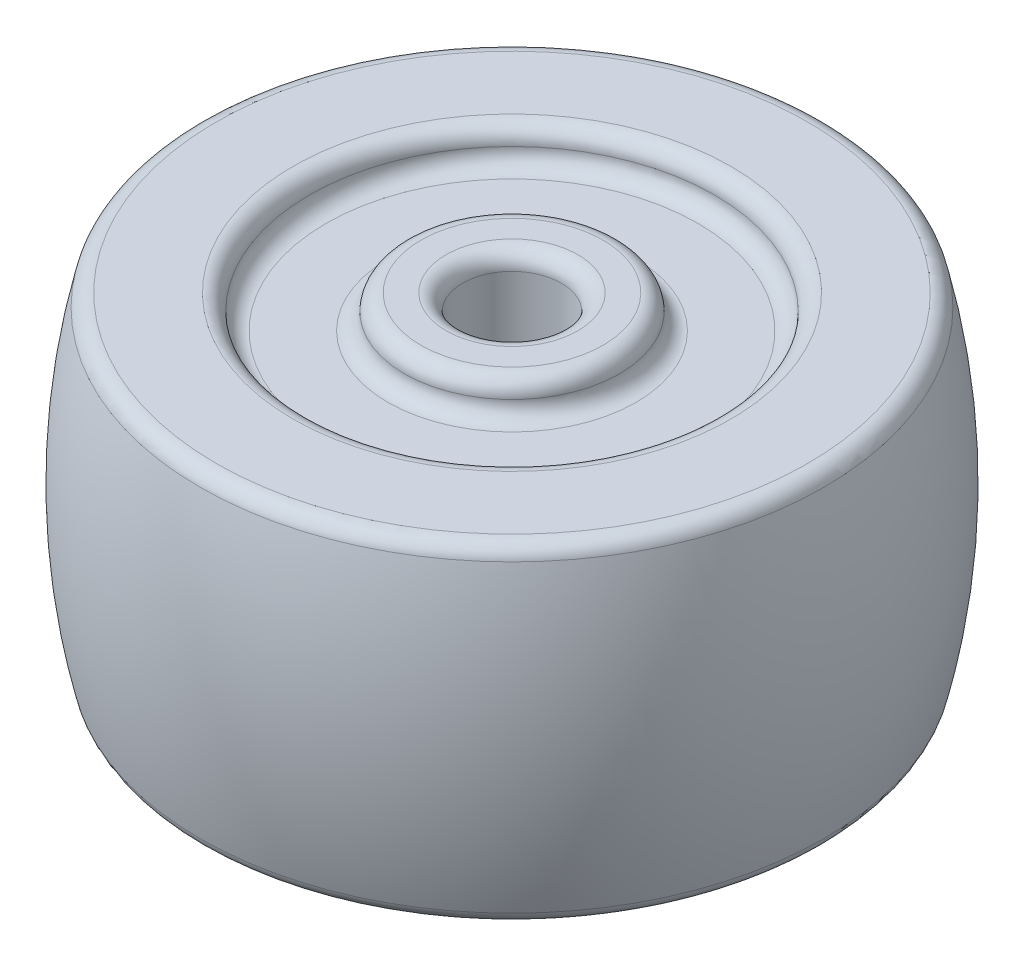
ISO-10303-21;
HEADER;
FILE_DESCRIPTION(('STEP AP214'),'2;1');
FILE_NAME('part.step','',(''),(''),'','','');
FILE_SCHEMA(('AUTOMOTIVE_DESIGN { 1 0 10303 214 1 1 1 1 }'));
ENDSEC;
DATA;
#1=APPLICATION_CONTEXT('core data for automotive mechanical design processes');
#2=APPLICATION_PROTOCOL_DEFINITION('international standard','automotive_design',2000,#1);
#3=PRODUCT_CONTEXT('',#1,'mechanical');
#4=PRODUCT('Part','Part','',(#3));
#5=PRODUCT_RELATED_PRODUCT_CATEGORY('part','',(#4));
#6=PRODUCT_DEFINITION_FORMATION('','',#4);
#7=PRODUCT_DEFINITION_CONTEXT('part definition',#1,'design');
#8=PRODUCT_DEFINITION('design','',#6,#7);
#9=PRODUCT_DEFINITION_SHAPE('','',#8);
#10=(LENGTH_UNIT() NAMED_UNIT(*) SI_UNIT(.MILLI.,.METRE.));
#11=(NAMED_UNIT(*) PLANE_ANGLE_UNIT() SI_UNIT($,.RADIAN.));
#12=(NAMED_UNIT(*) SI_UNIT($,.STERADIAN.) SOLID_ANGLE_UNIT());
#13=UNCERTAINTY_MEASURE_WITH_UNIT(LENGTH_MEASURE(1.E-05),#10,'distance_accuracy_value','');
#14=(GEOMETRIC_REPRESENTATION_CONTEXT(3) GLOBAL_UNCERTAINTY_ASSIGNED_CONTEXT((#13)) GLOBAL_UNIT_ASSIGNED_CONTEXT((#10,
#11,#12)) REPRESENTATION_CONTEXT('',''));
#15=CARTESIAN_POINT('',(0.,0.,0.));
#16=DIRECTION('',(0.,0.,1.));
#17=DIRECTION('',(1.,0.,0.));
#18=AXIS2_PLACEMENT_3D('',#15,#16,#17);
#19=CARTESIAN_POINT('',(0.,10.,0.));
#20=DIRECTION('',(0.,1.,0.));
#21=DIRECTION('',(0.,0.,1.));
#22=AXIS2_PLACEMENT_3D('',#19,#20,#21);
#23=PLANE('',#22);
#24=CARTESIAN_POINT('',(0.,10.,0.));
#25=DIRECTION('',(0.,1.,0.));
#26=DIRECTION('',(0.,0.,1.));
#27=AXIS2_PLACEMENT_3D('',#24,#25,#26);
#28=CIRCLE('',#27,13.2832027979486);
#29=CARTESIAN_POINT('',(0.,10.,13.2832027979486));
#30=VERTEX_POINT('',#29);
#31=EDGE_CURVE('E10',#30,#30,#28,.F.);
#32=ORIENTED_EDGE('',*,*,#31,.T.);
#33=EDGE_LOOP('',(#32));
#34=FACE_BOUND('',#33,.T.);
#35=CARTESIAN_POINT('',(0.,10.,0.));
#36=DIRECTION('',(0.,1.,0.));
#37=DIRECTION('',(0.,0.,1.));
#38=AXIS2_PLACEMENT_3D('',#35,#36,#37);
#39=CIRCLE('',#38,17.9473319220205);
#40=CARTESIAN_POINT('',(0.,10.,17.9473319220205));
#41=VERTEX_POINT('',#40);
#42=EDGE_CURVE('E42',#41,#41,#39,.T.);
#43=ORIENTED_EDGE('',*,*,#42,.T.);
#44=EDGE_LOOP('',(#43));
#45=FACE_BOUND('',#44,.T.);
#46=ADVANCED_FACE('F34',(#34,#45),#23,.T.);
#47=CARTESIAN_POINT('',(0.,0.,0.));
#48=DIRECTION('',(0.,1.,0.));
#49=DIRECTION('',(0.,0.,1.));
#50=AXIS2_PLACEMENT_3D('',#47,#48,#49);
#51=DEGENERATE_TOROIDAL_SURFACE('',#50,20.,40.,.F.);
#52=CARTESIAN_POINT('',(0.,-9.23076923076923,0.));
#53=DIRECTION('',(0.,1.,0.));
#54=DIRECTION('',(0.,0.,1.));
#55=AXIS2_PLACEMENT_3D('',#52,#53,#54);
#56=CIRCLE('',#55,18.9203404328416);
#57=CARTESIAN_POINT('',(0.,-9.23076923076923,18.9203404328416));
#58=VERTEX_POINT('',#57);
#59=EDGE_CURVE('E176',#58,#58,#56,.T.);
#60=ORIENTED_EDGE('',*,*,#59,.T.);
#61=EDGE_LOOP('',(#60));
#62=FACE_BOUND('',#61,.T.);
#63=CARTESIAN_POINT('',(0.,9.23076923076923,0.));
#64=DIRECTION('',(0.,-1.,0.));
#65=DIRECTION('',(0.,0.,-1.));
#66=AXIS2_PLACEMENT_3D('',#63,#64,#65);
#67=CIRCLE('',#66,18.9203404328416);
#68=CARTESIAN_POINT('',(0.,9.23076923076923,-18.9203404328416));
#69=VERTEX_POINT('',#68);
#70=EDGE_CURVE('E173',#69,#69,#67,.T.);
#71=ORIENTED_EDGE('',*,*,#70,.T.);
#72=EDGE_LOOP('',(#71));
#73=FACE_BOUND('',#72,.T.);
#74=ADVANCED_FACE('F80',(#62,#73),#51,.F.);
#75=CARTESIAN_POINT('',(0.,-10.,0.));
#76=DIRECTION('',(0.,1.,0.));
#77=DIRECTION('',(0.,0.,1.));
#78=AXIS2_PLACEMENT_3D('',#75,#76,#77);
#79=PLANE('',#78);
#80=CARTESIAN_POINT('',(0.,-10.,0.));
#81=DIRECTION('',(0.,1.,0.));
#82=DIRECTION('',(0.,0.,1.));
#83=AXIS2_PLACEMENT_3D('',#80,#81,#82);
#84=CIRCLE('',#83,13.2832027979486);
#85=CARTESIAN_POINT('',(0.,-10.,13.2832027979486));
#86=VERTEX_POINT('',#85);
#87=EDGE_CURVE('E177',#86,#86,#84,.T.);
#88=ORIENTED_EDGE('',*,*,#87,.T.);
#89=EDGE_LOOP('',(#88));
#90=FACE_BOUND('',#89,.T.);
#91=CARTESIAN_POINT('',(0.,-10.,0.));
#92=DIRECTION('',(0.,1.,0.));
#93=DIRECTION('',(0.,0.,1.));
#94=AXIS2_PLACEMENT_3D('',#91,#92,#93);
#95=CIRCLE('',#94,17.9473319220205);
#96=CARTESIAN_POINT('',(0.,-10.,17.9473319220205));
#97=VERTEX_POINT('',#96);
#98=EDGE_CURVE('E183',#97,#97,#95,.F.);
#99=ORIENTED_EDGE('',*,*,#98,.T.);
#100=EDGE_LOOP('',(#99));
#101=FACE_BOUND('',#100,.T.);
#102=ADVANCED_FACE('F85',(#90,#101),#79,.F.);
#103=CARTESIAN_POINT('',(0.,-8.,0.));
#104=DIRECTION('',(0.,-1.,0.));
#105=DIRECTION('',(0.,0.,-1.));
#106=AXIS2_PLACEMENT_3D('',#103,#104,#105);
#107=PLANE('',#106);
#108=CARTESIAN_POINT('',(0.,-8.,0.));
#109=DIRECTION('',(0.,-1.,0.));
#110=DIRECTION('',(0.,0.,-1.));
#111=AXIS2_PLACEMENT_3D('',#108,#109,#110);
#112=CIRCLE('',#111,11.2832027979486);
#113=CARTESIAN_POINT('',(0.,-8.,-11.2832027979486));
#114=VERTEX_POINT('',#113);
#115=EDGE_CURVE('E249',#114,#114,#112,.T.);
#116=ORIENTED_EDGE('',*,*,#115,.T.);
#117=EDGE_LOOP('',(#116));
#118=FACE_BOUND('',#117,.T.);
#119=CARTESIAN_POINT('',(0.,-8.,0.));
#120=DIRECTION('',(0.,1.,0.));
#121=DIRECTION('',(0.,0.,1.));
#122=AXIS2_PLACEMENT_3D('',#119,#120,#121);
#123=CIRCLE('',#122,6.52854703681058);
#124=CARTESIAN_POINT('',(0.,-8.,6.52854703681058));
#125=VERTEX_POINT('',#124);
#126=EDGE_CURVE('E53',#125,#125,#123,.T.);
#127=ORIENTED_EDGE('',*,*,#126,.T.);
#128=EDGE_LOOP('',(#127));
#129=FACE_BOUND('',#128,.T.);
#130=ADVANCED_FACE('F216',(#118,#129),#107,.T.);
#131=CARTESIAN_POINT('',(0.,10.,0.));
#132=DIRECTION('',(0.,1.,0.));
#133=DIRECTION('',(0.,0.,1.));
#134=AXIS2_PLACEMENT_3D('',#131,#132,#133);
#135=CYLINDRICAL_SURFACE('',#134,6.52854703681058);
#136=CARTESIAN_POINT('',(0.,-9.,0.));
#137=DIRECTION('',(0.,1.,0.));
#138=DIRECTION('',(0.,0.,1.));
#139=AXIS2_PLACEMENT_3D('',#136,#137,#138);
#140=CIRCLE('',#139,6.52854703681058);
#141=CARTESIAN_POINT('',(0.,-9.,6.52854703681058));
#142=VERTEX_POINT('',#141);
#143=EDGE_CURVE('E202',#142,#142,#140,.T.);
#144=ORIENTED_EDGE('',*,*,#143,.T.);
#145=EDGE_LOOP('',(#144));
#146=FACE_BOUND('',#145,.T.);
#147=ORIENTED_EDGE('',*,*,#126,.F.);
#148=EDGE_LOOP('',(#147));
#149=FACE_BOUND('',#148,.T.);
#150=ADVANCED_FACE('F221',(#146,#149),#135,.T.);
#151=CARTESIAN_POINT('',(0.,-10.,0.));
#152=DIRECTION('',(0.,1.,0.));
#153=DIRECTION('',(0.,0.,1.));
#154=AXIS2_PLACEMENT_3D('',#151,#152,#153);
#155=PLANE('',#154);
#156=CARTESIAN_POINT('',(0.,-10.,0.));
#157=DIRECTION('',(0.,1.,0.));
#158=DIRECTION('',(0.,0.,1.));
#159=AXIS2_PLACEMENT_3D('',#156,#157,#158);
#160=CIRCLE('',#159,4.);
#161=CARTESIAN_POINT('',(0.,-10.,4.));
#162=VERTEX_POINT('',#161);
#163=EDGE_CURVE('E199',#162,#162,#160,.T.);
#164=ORIENTED_EDGE('',*,*,#163,.T.);
#165=EDGE_LOOP('',(#164));
#166=FACE_BOUND('',#165,.T.);
#167=CARTESIAN_POINT('',(0.,-10.,0.));
#168=DIRECTION('',(0.,1.,0.));
#169=DIRECTION('',(0.,0.,1.));
#170=AXIS2_PLACEMENT_3D('',#167,#168,#169);
#171=CIRCLE('',#170,5.52854703681058);
#172=CARTESIAN_POINT('',(0.,-10.,5.52854703681058));
#173=VERTEX_POINT('',#172);
#174=EDGE_CURVE('E205',#173,#173,#171,.F.);
#175=ORIENTED_EDGE('',*,*,#174,.T.);
#176=EDGE_LOOP('',(#175));
#177=FACE_BOUND('',#176,.T.);
#178=ADVANCED_FACE('F227',(#166,#177),#155,.F.);
#179=CARTESIAN_POINT('',(0.,10.,0.));
#180=DIRECTION('',(0.,1.,0.));
#181=DIRECTION('',(0.,0.,1.));
#182=AXIS2_PLACEMENT_3D('',#179,#180,#181);
#183=CYLINDRICAL_SURFACE('',#182,3.);
#184=CARTESIAN_POINT('',(0.,-9.,0.));
#185=DIRECTION('',(0.,1.,0.));
#186=DIRECTION('',(0.,0.,1.));
#187=AXIS2_PLACEMENT_3D('',#184,#185,#186);
#188=CIRCLE('',#187,3.);
#189=CARTESIAN_POINT('',(0.,-9.,3.));
#190=VERTEX_POINT('',#189);
#191=EDGE_CURVE('E198',#190,#190,#188,.F.);
#192=ORIENTED_EDGE('',*,*,#191,.T.);
#193=EDGE_LOOP('',(#192));
#194=FACE_BOUND('',#193,.T.);
#195=CARTESIAN_POINT('',(0.,9.,0.));
#196=DIRECTION('',(0.,1.,0.));
#197=DIRECTION('',(0.,0.,1.));
#198=AXIS2_PLACEMENT_3D('',#195,#196,#197);
#199=CIRCLE('',#198,3.);
#200=CARTESIAN_POINT('',(0.,9.,3.));
#201=VERTEX_POINT('',#200);
#202=EDGE_CURVE('E196',#201,#201,#199,.T.);
#203=ORIENTED_EDGE('',*,*,#202,.T.);
#204=EDGE_LOOP('',(#203));
#205=FACE_BOUND('',#204,.T.);
#206=ADVANCED_FACE('F231',(#194,#205),#183,.F.);
#207=CARTESIAN_POINT('',(0.,10.,0.));
#208=DIRECTION('',(0.,1.,0.));
#209=DIRECTION('',(0.,0.,1.));
#210=AXIS2_PLACEMENT_3D('',#207,#208,#209);
#211=PLANE('',#210);
#212=CARTESIAN_POINT('',(0.,10.,0.));
#213=DIRECTION('',(0.,1.,0.));
#214=DIRECTION('',(0.,0.,1.));
#215=AXIS2_PLACEMENT_3D('',#212,#213,#214);
#216=CIRCLE('',#215,4.);
#217=CARTESIAN_POINT('',(0.,10.,4.));
#218=VERTEX_POINT('',#217);
#219=EDGE_CURVE('E47',#218,#218,#216,.F.);
#220=ORIENTED_EDGE('',*,*,#219,.T.);
#221=EDGE_LOOP('',(#220));
#222=FACE_BOUND('',#221,.T.);
#223=CARTESIAN_POINT('',(0.,10.,0.));
#224=DIRECTION('',(0.,1.,0.));
#225=DIRECTION('',(0.,0.,1.));
#226=AXIS2_PLACEMENT_3D('',#223,#224,#225);
#227=CIRCLE('',#226,5.52854703681058);
#228=CARTESIAN_POINT('',(0.,10.,5.52854703681058));
#229=VERTEX_POINT('',#228);
#230=EDGE_CURVE('E180',#229,#229,#227,.T.);
#231=ORIENTED_EDGE('',*,*,#230,.T.);
#232=EDGE_LOOP('',(#231));
#233=FACE_BOUND('',#232,.T.);
#234=ADVANCED_FACE('F191',(#222,#233),#211,.T.);
#235=CARTESIAN_POINT('',(0.,8.,0.));
#236=DIRECTION('',(0.,-1.,0.));
#237=DIRECTION('',(0.,0.,-1.));
#238=AXIS2_PLACEMENT_3D('',#235,#236,#237);
#239=PLANE('',#238);
#240=CARTESIAN_POINT('',(0.,8.,0.));
#241=DIRECTION('',(0.,-1.,0.));
#242=DIRECTION('',(0.,0.,-1.));
#243=AXIS2_PLACEMENT_3D('',#240,#241,#242);
#244=CIRCLE('',#243,11.2832027979486);
#245=CARTESIAN_POINT('',(0.,8.,-11.2832027979486));
#246=VERTEX_POINT('',#245);
#247=EDGE_CURVE('E245',#246,#246,#244,.F.);
#248=ORIENTED_EDGE('',*,*,#247,.T.);
#249=EDGE_LOOP('',(#248));
#250=FACE_BOUND('',#249,.T.);
#251=CARTESIAN_POINT('',(0.,8.,0.));
#252=DIRECTION('',(0.,-1.,0.));
#253=DIRECTION('',(0.,0.,-1.));
#254=AXIS2_PLACEMENT_3D('',#251,#252,#253);
#255=CIRCLE('',#254,7.52854703681058);
#256=CARTESIAN_POINT('',(0.,8.,-7.52854703681058));
#257=VERTEX_POINT('',#256);
#258=EDGE_CURVE('E248',#257,#257,#255,.T.);
#259=ORIENTED_EDGE('',*,*,#258,.T.);
#260=EDGE_LOOP('',(#259));
#261=FACE_BOUND('',#260,.T.);
#262=ADVANCED_FACE('F97',(#250,#261),#239,.F.);
#263=CARTESIAN_POINT('',(0.,-9.,0.));
#264=DIRECTION('',(0.,1.,0.));
#265=DIRECTION('',(0.,0.,1.));
#266=AXIS2_PLACEMENT_3D('',#263,#264,#265);
#267=TOROIDAL_SURFACE('',#266,13.2832027979486,1.);
#268=ORIENTED_EDGE('',*,*,#87,.F.);
#269=EDGE_LOOP('',(#268));
#270=FACE_BOUND('',#269,.T.);
#271=CARTESIAN_POINT('',(0.,-9.,0.));
#272=DIRECTION('',(0.,1.,0.));
#273=DIRECTION('',(0.,0.,1.));
#274=AXIS2_PLACEMENT_3D('',#271,#272,#273);
#275=CIRCLE('',#274,12.2832027979486);
#276=CARTESIAN_POINT('',(0.,-9.,12.2832027979486));
#277=VERTEX_POINT('',#276);
#278=EDGE_CURVE('E51',#277,#277,#275,.F.);
#279=ORIENTED_EDGE('',*,*,#278,.F.);
#280=EDGE_LOOP('',(#279));
#281=FACE_BOUND('',#280,.T.);
#282=ADVANCED_FACE('F94',(#270,#281),#267,.T.);
#283=CARTESIAN_POINT('',(0.,-9.,0.));
#284=DIRECTION('',(0.,-1.,0.));
#285=DIRECTION('',(0.,0.,-1.));
#286=AXIS2_PLACEMENT_3D('',#283,#284,#285);
#287=TOROIDAL_SURFACE('',#286,11.2832027979486,1.);
#288=ORIENTED_EDGE('',*,*,#115,.F.);
#289=EDGE_LOOP('',(#288));
#290=FACE_BOUND('',#289,.T.);
#291=ORIENTED_EDGE('',*,*,#278,.T.);
#292=EDGE_LOOP('',(#291));
#293=FACE_BOUND('',#292,.T.);
#294=ADVANCED_FACE('F91',(#290,#293),#287,.F.);
#295=CARTESIAN_POINT('',(0.,9.,0.));
#296=DIRECTION('',(0.,1.,0.));
#297=DIRECTION('',(0.,0.,1.));
#298=AXIS2_PLACEMENT_3D('',#295,#296,#297);
#299=TOROIDAL_SURFACE('',#298,13.2832027979486,1.);
#300=ORIENTED_EDGE('',*,*,#31,.F.);
#301=EDGE_LOOP('',(#300));
#302=FACE_BOUND('',#301,.T.);
#303=CARTESIAN_POINT('',(0.,9.,0.));
#304=DIRECTION('',(0.,1.,0.));
#305=DIRECTION('',(0.,0.,1.));
#306=AXIS2_PLACEMENT_3D('',#303,#304,#305);
#307=CIRCLE('',#306,12.2832027979486);
#308=CARTESIAN_POINT('',(0.,9.,12.2832027979486));
#309=VERTEX_POINT('',#308);
#310=EDGE_CURVE('E54',#309,#309,#307,.T.);
#311=ORIENTED_EDGE('',*,*,#310,.F.);
#312=EDGE_LOOP('',(#311));
#313=FACE_BOUND('',#312,.T.);
#314=ADVANCED_FACE('F75',(#302,#313),#299,.T.);
#315=CARTESIAN_POINT('',(0.,9.,0.));
#316=DIRECTION('',(0.,-1.,0.));
#317=DIRECTION('',(0.,0.,-1.));
#318=AXIS2_PLACEMENT_3D('',#315,#316,#317);
#319=TOROIDAL_SURFACE('',#318,11.2832027979486,1.);
#320=ORIENTED_EDGE('',*,*,#310,.T.);
#321=EDGE_LOOP('',(#320));
#322=FACE_BOUND('',#321,.T.);
#323=ORIENTED_EDGE('',*,*,#247,.F.);
#324=EDGE_LOOP('',(#323));
#325=FACE_BOUND('',#324,.T.);
#326=ADVANCED_FACE('F65',(#322,#325),#319,.F.);
#327=CARTESIAN_POINT('',(0.,9.,0.));
#328=DIRECTION('',(0.,1.,0.));
#329=DIRECTION('',(0.,0.,1.));
#330=AXIS2_PLACEMENT_3D('',#327,#328,#329);
#331=TOROIDAL_SURFACE('',#330,5.52854703681058,1.);
#332=ORIENTED_EDGE('',*,*,#230,.F.);
#333=EDGE_LOOP('',(#332));
#334=FACE_BOUND('',#333,.T.);
#335=CARTESIAN_POINT('',(0.,9.,0.));
#336=DIRECTION('',(0.,1.,0.));
#337=DIRECTION('',(0.,0.,1.));
#338=AXIS2_PLACEMENT_3D('',#335,#336,#337);
#339=CIRCLE('',#338,6.52854703681058);
#340=CARTESIAN_POINT('',(0.,9.,6.52854703681058));
#341=VERTEX_POINT('',#340);
#342=EDGE_CURVE('E38',#341,#341,#339,.F.);
#343=ORIENTED_EDGE('',*,*,#342,.F.);
#344=EDGE_LOOP('',(#343));
#345=FACE_BOUND('',#344,.T.);
#346=ADVANCED_FACE('F63',(#334,#345),#331,.T.);
#347=CARTESIAN_POINT('',(0.,9.,0.));
#348=DIRECTION('',(0.,-1.,0.));
#349=DIRECTION('',(0.,0.,-1.));
#350=AXIS2_PLACEMENT_3D('',#347,#348,#349);
#351=TOROIDAL_SURFACE('',#350,7.52854703681058,1.);
#352=ORIENTED_EDGE('',*,*,#258,.F.);
#353=EDGE_LOOP('',(#352));
#354=FACE_BOUND('',#353,.T.);
#355=ORIENTED_EDGE('',*,*,#342,.T.);
#356=EDGE_LOOP('',(#355));
#357=FACE_BOUND('',#356,.T.);
#358=ADVANCED_FACE('F61',(#354,#357),#351,.F.);
#359=CARTESIAN_POINT('',(0.,-9.,0.));
#360=DIRECTION('',(0.,1.,0.));
#361=DIRECTION('',(0.,0.,1.));
#362=AXIS2_PLACEMENT_3D('',#359,#360,#361);
#363=TOROIDAL_SURFACE('',#362,4.,1.);
#364=ORIENTED_EDGE('',*,*,#191,.F.);
#365=EDGE_LOOP('',(#364));
#366=FACE_BOUND('',#365,.T.);
#367=ORIENTED_EDGE('',*,*,#163,.F.);
#368=EDGE_LOOP('',(#367));
#369=FACE_BOUND('',#368,.T.);
#370=ADVANCED_FACE('F72',(#366,#369),#363,.T.);
#371=CARTESIAN_POINT('',(0.,-9.,0.));
#372=DIRECTION('',(0.,1.,0.));
#373=DIRECTION('',(0.,0.,1.));
#374=AXIS2_PLACEMENT_3D('',#371,#372,#373);
#375=TOROIDAL_SURFACE('',#374,5.52854703681058,1.);
#376=ORIENTED_EDGE('',*,*,#174,.F.);
#377=EDGE_LOOP('',(#376));
#378=FACE_BOUND('',#377,.T.);
#379=ORIENTED_EDGE('',*,*,#143,.F.);
#380=EDGE_LOOP('',(#379));
#381=FACE_BOUND('',#380,.T.);
#382=ADVANCED_FACE('F130',(#378,#381),#375,.T.);
#383=CARTESIAN_POINT('',(0.,-9.,0.));
#384=DIRECTION('',(0.,1.,0.));
#385=DIRECTION('',(0.,0.,1.));
#386=AXIS2_PLACEMENT_3D('',#383,#384,#385);
#387=TOROIDAL_SURFACE('',#386,17.9473319220205,1.);
#388=ORIENTED_EDGE('',*,*,#98,.F.);
#389=EDGE_LOOP('',(#388));
#390=FACE_BOUND('',#389,.T.);
#391=ORIENTED_EDGE('',*,*,#59,.F.);
#392=EDGE_LOOP('',(#391));
#393=FACE_BOUND('',#392,.T.);
#394=ADVANCED_FACE('F139',(#390,#393),#387,.T.);
#395=CARTESIAN_POINT('',(0.,9.,0.));
#396=DIRECTION('',(0.,1.,0.));
#397=DIRECTION('',(0.,0.,1.));
#398=AXIS2_PLACEMENT_3D('',#395,#396,#397);
#399=TOROIDAL_SURFACE('',#398,4.,1.);
#400=ORIENTED_EDGE('',*,*,#219,.F.);
#401=EDGE_LOOP('',(#400));
#402=FACE_BOUND('',#401,.T.);
#403=ORIENTED_EDGE('',*,*,#202,.F.);
#404=EDGE_LOOP('',(#403));
#405=FACE_BOUND('',#404,.T.);
#406=ADVANCED_FACE('F149',(#402,#405),#399,.T.);
#407=CARTESIAN_POINT('',(0.,9.,0.));
#408=DIRECTION('',(0.,1.,0.));
#409=DIRECTION('',(0.,0.,1.));
#410=AXIS2_PLACEMENT_3D('',#407,#408,#409);
#411=TOROIDAL_SURFACE('',#410,17.9473319220205,1.);
#412=ORIENTED_EDGE('',*,*,#70,.F.);
#413=EDGE_LOOP('',(#412));
#414=FACE_BOUND('',#413,.T.);
#415=ORIENTED_EDGE('',*,*,#42,.F.);
#416=EDGE_LOOP('',(#415));
#417=FACE_BOUND('',#416,.T.);
#418=ADVANCED_FACE('F36',(#414,#417),#411,.T.);
#419=CLOSED_SHELL('',(#46,#74,#102,#130,#150,#178,#206,#234,#262,#282,#294,#314,#326,#346,#358,
#370,#382,#394,#406,#418));
#420=MANIFOLD_SOLID_BREP('B2',#419);
#421=ADVANCED_BREP_SHAPE_REPRESENTATION('',(#18,#420),#14);
#422=SHAPE_DEFINITION_REPRESENTATION(#9,#421);
ENDSEC;
END-ISO-10303-21;
